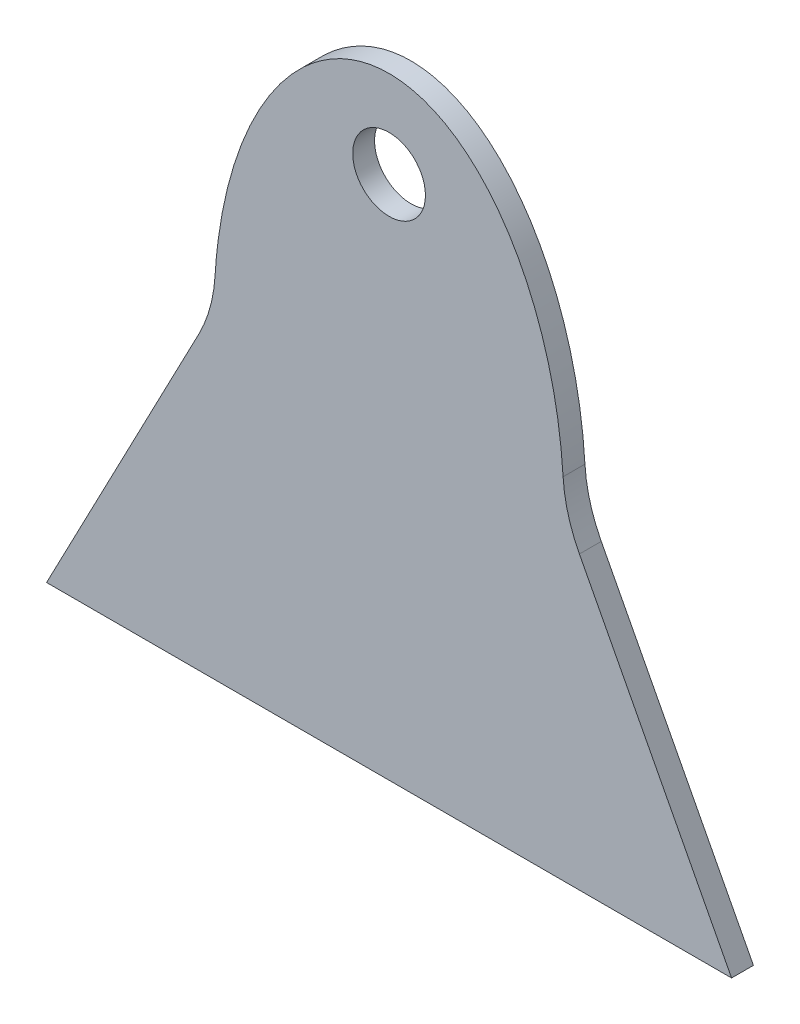
ISO-10303-21;
HEADER;
FILE_DESCRIPTION(('STEP AP214'),'2;1');
FILE_NAME('part.step','',(''),(''),'','','');
FILE_SCHEMA(('AUTOMOTIVE_DESIGN { 1 0 10303 214 1 1 1 1 }'));
ENDSEC;
DATA;
#1=APPLICATION_CONTEXT('core data for automotive mechanical design processes');
#2=APPLICATION_PROTOCOL_DEFINITION('international standard','automotive_design',2000,#1);
#3=PRODUCT_CONTEXT('',#1,'mechanical');
#4=PRODUCT('Part','Part','',(#3));
#5=PRODUCT_RELATED_PRODUCT_CATEGORY('part','',(#4));
#6=PRODUCT_DEFINITION_FORMATION('','',#4);
#7=PRODUCT_DEFINITION_CONTEXT('part definition',#1,'design');
#8=PRODUCT_DEFINITION('design','',#6,#7);
#9=PRODUCT_DEFINITION_SHAPE('','',#8);
#10=(LENGTH_UNIT() NAMED_UNIT(*) SI_UNIT(.MILLI.,.METRE.));
#11=(NAMED_UNIT(*) PLANE_ANGLE_UNIT() SI_UNIT($,.RADIAN.));
#12=(NAMED_UNIT(*) SI_UNIT($,.STERADIAN.) SOLID_ANGLE_UNIT());
#13=UNCERTAINTY_MEASURE_WITH_UNIT(LENGTH_MEASURE(1.E-05),#10,'distance_accuracy_value','');
#14=(GEOMETRIC_REPRESENTATION_CONTEXT(3) GLOBAL_UNCERTAINTY_ASSIGNED_CONTEXT((#13)) GLOBAL_UNIT_ASSIGNED_CONTEXT((#10,
#11,#12)) REPRESENTATION_CONTEXT('',''));
#15=CARTESIAN_POINT('',(0.,0.,0.));
#16=DIRECTION('',(0.,0.,1.));
#17=DIRECTION('',(1.,0.,0.));
#18=AXIS2_PLACEMENT_3D('',#15,#16,#17);
#19=CARTESIAN_POINT('',(0.,0.,19.05));
#20=DIRECTION('',(0.,0.,1.));
#21=DIRECTION('',(1.,0.,0.));
#22=AXIS2_PLACEMENT_3D('',#19,#20,#21);
#23=PLANE('',#22);
#24=DIRECTION('',(-0.463254209343681,0.88622544396184,0.));
#25=VECTOR('',#24,1.);
#26=CARTESIAN_POINT('',(152.4,0.,19.05));
#27=LINE('',#26,#25);
#28=CARTESIAN_POINT('',(298.45,-279.400000000005,19.05));
#29=VERTEX_POINT('',#28);
#30=CARTESIAN_POINT('',(165.851866868121,-25.7340061824933,19.05));
#31=VERTEX_POINT('',#30);
#32=EDGE_CURVE('E114',#29,#31,#27,.T.);
#33=ORIENTED_EDGE('',*,*,#32,.T.);
#34=CARTESIAN_POINT('',(278.402498251275,33.0992784041542,19.05));
#35=DIRECTION('',(0.,0.,1.));
#36=DIRECTION('',(1.,0.,0.));
#37=AXIS2_PLACEMENT_3D('',#34,#35,#36);
#38=CIRCLE('',#37,127.);
#39=CARTESIAN_POINT('',(151.633548073588,25.4420419021757,19.05));
#40=VERTEX_POINT('',#39);
#41=EDGE_CURVE('E11',#31,#40,#38,.F.);
#42=ORIENTED_EDGE('',*,*,#41,.T.);
#43=CARTESIAN_POINT('',(0.,0.,19.05));
#44=DIRECTION('',(0.,0.,1.));
#45=DIRECTION('',(0.,1.,0.));
#46=AXIS2_PLACEMENT_3D('',#43,#44,#45);
#47=ELLIPSE('',#46,254.,152.4);
#48=CARTESIAN_POINT('',(-151.633548073588,25.4420419021757,19.05));
#49=VERTEX_POINT('',#48);
#50=EDGE_CURVE('E133',#40,#49,#47,.T.);
#51=ORIENTED_EDGE('',*,*,#50,.T.);
#52=CARTESIAN_POINT('',(-278.402498251275,33.0992784041542,19.05));
#53=DIRECTION('',(0.,0.,1.));
#54=DIRECTION('',(1.,0.,0.));
#55=AXIS2_PLACEMENT_3D('',#52,#53,#54);
#56=CIRCLE('',#55,127.);
#57=CARTESIAN_POINT('',(-165.851866868121,-25.7340061824933,19.05));
#58=VERTEX_POINT('',#57);
#59=EDGE_CURVE('E100',#49,#58,#56,.F.);
#60=ORIENTED_EDGE('',*,*,#59,.T.);
#61=DIRECTION('',(-0.463254209343681,-0.88622544396184,0.));
#62=VECTOR('',#61,1.);
#63=CARTESIAN_POINT('',(-152.4,0.,19.05));
#64=LINE('',#63,#62);
#65=CARTESIAN_POINT('',(-298.45,-279.400000000005,19.05));
#66=VERTEX_POINT('',#65);
#67=EDGE_CURVE('E93',#58,#66,#64,.T.);
#68=ORIENTED_EDGE('',*,*,#67,.T.);
#69=DIRECTION('',(1.,0.,0.));
#70=VECTOR('',#69,1.);
#71=CARTESIAN_POINT('',(298.45,-279.400000000005,19.05));
#72=LINE('',#71,#70);
#73=EDGE_CURVE('E97',#66,#29,#72,.T.);
#74=ORIENTED_EDGE('',*,*,#73,.T.);
#75=EDGE_LOOP('',(#33,#42,#51,#60,#68,#74));
#76=FACE_BOUND('',#75,.T.);
#77=CARTESIAN_POINT('',(0.,177.8,19.05));
#78=DIRECTION('',(0.,0.,1.));
#79=DIRECTION('',(1.,0.,0.));
#80=AXIS2_PLACEMENT_3D('',#77,#78,#79);
#81=CIRCLE('',#80,31.6865);
#82=CARTESIAN_POINT('',(31.6865,177.8,19.05));
#83=VERTEX_POINT('',#82);
#84=EDGE_CURVE('E127',#83,#83,#81,.T.);
#85=ORIENTED_EDGE('',*,*,#84,.F.);
#86=EDGE_LOOP('',(#85));
#87=FACE_BOUND('',#86,.T.);
#88=ADVANCED_FACE('F41',(#76,#87),#23,.T.);
#89=CARTESIAN_POINT('',(0.,0.,0.));
#90=DIRECTION('',(0.,0.,1.));
#91=DIRECTION('',(1.,0.,0.));
#92=AXIS2_PLACEMENT_3D('',#89,#90,#91);
#93=PLANE('',#92);
#94=CARTESIAN_POINT('',(0.,0.,0.));
#95=DIRECTION('',(0.,0.,1.));
#96=DIRECTION('',(0.,1.,0.));
#97=AXIS2_PLACEMENT_3D('',#94,#95,#96);
#98=ELLIPSE('',#97,254.,152.4);
#99=CARTESIAN_POINT('',(151.633548073588,25.4420419021757,0.));
#100=VERTEX_POINT('',#99);
#101=CARTESIAN_POINT('',(-151.633548073588,25.4420419021757,0.));
#102=VERTEX_POINT('',#101);
#103=EDGE_CURVE('E130',#100,#102,#98,.T.);
#104=ORIENTED_EDGE('',*,*,#103,.F.);
#105=CARTESIAN_POINT('',(278.402498251275,33.0992784041542,0.));
#106=DIRECTION('',(0.,0.,1.));
#107=DIRECTION('',(1.,0.,0.));
#108=AXIS2_PLACEMENT_3D('',#105,#106,#107);
#109=CIRCLE('',#108,127.);
#110=CARTESIAN_POINT('',(165.851866868121,-25.7340061824933,0.));
#111=VERTEX_POINT('',#110);
#112=EDGE_CURVE('E49',#100,#111,#109,.T.);
#113=ORIENTED_EDGE('',*,*,#112,.T.);
#114=DIRECTION('',(0.463254209343681,-0.88622544396184,0.));
#115=VECTOR('',#114,1.);
#116=CARTESIAN_POINT('',(152.4,0.,0.));
#117=LINE('',#116,#115);
#118=CARTESIAN_POINT('',(298.45,-279.400000000005,0.));
#119=VERTEX_POINT('',#118);
#120=EDGE_CURVE('E126',#111,#119,#117,.T.);
#121=ORIENTED_EDGE('',*,*,#120,.T.);
#122=DIRECTION('',(-1.,0.,0.));
#123=VECTOR('',#122,1.);
#124=CARTESIAN_POINT('',(298.45,-279.400000000005,0.));
#125=LINE('',#124,#123);
#126=CARTESIAN_POINT('',(-298.45,-279.400000000005,0.));
#127=VERTEX_POINT('',#126);
#128=EDGE_CURVE('E122',#119,#127,#125,.T.);
#129=ORIENTED_EDGE('',*,*,#128,.T.);
#130=DIRECTION('',(0.463254209343681,0.88622544396184,0.));
#131=VECTOR('',#130,1.);
#132=CARTESIAN_POINT('',(-152.4,0.,0.));
#133=LINE('',#132,#131);
#134=CARTESIAN_POINT('',(-165.851866868121,-25.7340061824933,0.));
#135=VERTEX_POINT('',#134);
#136=EDGE_CURVE('E110',#127,#135,#133,.T.);
#137=ORIENTED_EDGE('',*,*,#136,.T.);
#138=CARTESIAN_POINT('',(-278.402498251275,33.0992784041542,0.));
#139=DIRECTION('',(0.,0.,1.));
#140=DIRECTION('',(1.,0.,0.));
#141=AXIS2_PLACEMENT_3D('',#138,#139,#140);
#142=CIRCLE('',#141,127.);
#143=EDGE_CURVE('E172',#135,#102,#142,.T.);
#144=ORIENTED_EDGE('',*,*,#143,.T.);
#145=EDGE_LOOP('',(#104,#113,#121,#129,#137,#144));
#146=FACE_BOUND('',#145,.T.);
#147=CARTESIAN_POINT('',(0.,177.8,0.));
#148=DIRECTION('',(0.,0.,1.));
#149=DIRECTION('',(1.,0.,0.));
#150=AXIS2_PLACEMENT_3D('',#147,#148,#149);
#151=CIRCLE('',#150,31.6865);
#152=CARTESIAN_POINT('',(31.6865,177.8,0.));
#153=VERTEX_POINT('',#152);
#154=EDGE_CURVE('E125',#153,#153,#151,.T.);
#155=ORIENTED_EDGE('',*,*,#154,.T.);
#156=EDGE_LOOP('',(#155));
#157=FACE_BOUND('',#156,.T.);
#158=ADVANCED_FACE('F143',(#146,#157),#93,.F.);
#159=DIRECTION('',(0.,0.,-1.));
#160=VECTOR('',#159,1.);
#161=SURFACE_OF_LINEAR_EXTRUSION('',#47,#160);
#162=ORIENTED_EDGE('',*,*,#103,.T.);
#163=DIRECTION('',(0.,0.,-1.));
#164=VECTOR('',#163,1.);
#165=CARTESIAN_POINT('',(-151.633548073588,25.4420419021757,0.));
#166=LINE('',#165,#164);
#167=EDGE_CURVE('E173',#102,#49,#166,.F.);
#168=ORIENTED_EDGE('',*,*,#167,.T.);
#169=ORIENTED_EDGE('',*,*,#50,.F.);
#170=DIRECTION('',(0.,0.,-1.));
#171=VECTOR('',#170,1.);
#172=CARTESIAN_POINT('',(151.633548073588,25.4420419021757,19.05));
#173=LINE('',#172,#171);
#174=EDGE_CURVE('E176',#40,#100,#173,.T.);
#175=ORIENTED_EDGE('',*,*,#174,.T.);
#176=EDGE_LOOP('',(#162,#168,#169,#175));
#177=FACE_BOUND('',#176,.T.);
#178=ADVANCED_FACE('F139',(#177),#161,.F.);
#179=CARTESIAN_POINT('',(0.,177.8,19.05));
#180=DIRECTION('',(0.,0.,-1.));
#181=DIRECTION('',(-1.,0.,0.));
#182=AXIS2_PLACEMENT_3D('',#179,#180,#181);
#183=CYLINDRICAL_SURFACE('',#182,31.6865);
#184=ORIENTED_EDGE('',*,*,#84,.T.);
#185=EDGE_LOOP('',(#184));
#186=FACE_BOUND('',#185,.T.);
#187=ORIENTED_EDGE('',*,*,#154,.F.);
#188=EDGE_LOOP('',(#187));
#189=FACE_BOUND('',#188,.T.);
#190=ADVANCED_FACE('F142',(#186,#189),#183,.F.);
#191=CARTESIAN_POINT('',(152.4,0.,-659.055361862721));
#192=DIRECTION('',(0.88622544396184,0.463254209343681,0.));
#193=DIRECTION('',(-0.463254209343681,0.88622544396184,0.));
#194=AXIS2_PLACEMENT_3D('',#191,#192,#193);
#195=PLANE('',#194);
#196=ORIENTED_EDGE('',*,*,#120,.F.);
#197=DIRECTION('',(0.,0.,-1.));
#198=VECTOR('',#197,1.);
#199=CARTESIAN_POINT('',(165.851866868121,-25.7340061824933,-659.055361862721));
#200=LINE('',#199,#198);
#201=EDGE_CURVE('E56',#111,#31,#200,.F.);
#202=ORIENTED_EDGE('',*,*,#201,.T.);
#203=ORIENTED_EDGE('',*,*,#32,.F.);
#204=DIRECTION('',(0.,0.,1.));
#205=VECTOR('',#204,1.);
#206=CARTESIAN_POINT('',(298.45,-279.400000000005,-659.055361862721));
#207=LINE('',#206,#205);
#208=EDGE_CURVE('E113',#119,#29,#207,.T.);
#209=ORIENTED_EDGE('',*,*,#208,.F.);
#210=EDGE_LOOP('',(#196,#202,#203,#209));
#211=FACE_BOUND('',#210,.T.);
#212=ADVANCED_FACE('F162',(#211),#195,.T.);
#213=CARTESIAN_POINT('',(298.45,-279.400000000005,-659.055361862721));
#214=DIRECTION('',(0.,-1.,0.));
#215=DIRECTION('',(1.,0.,0.));
#216=AXIS2_PLACEMENT_3D('',#213,#214,#215);
#217=PLANE('',#216);
#218=ORIENTED_EDGE('',*,*,#128,.F.);
#219=ORIENTED_EDGE('',*,*,#208,.T.);
#220=ORIENTED_EDGE('',*,*,#73,.F.);
#221=DIRECTION('',(0.,0.,1.));
#222=VECTOR('',#221,1.);
#223=CARTESIAN_POINT('',(-298.45,-279.400000000005,-659.055361862721));
#224=LINE('',#223,#222);
#225=EDGE_CURVE('E107',#127,#66,#224,.T.);
#226=ORIENTED_EDGE('',*,*,#225,.F.);
#227=EDGE_LOOP('',(#218,#219,#220,#226));
#228=FACE_BOUND('',#227,.T.);
#229=ADVANCED_FACE('F116',(#228),#217,.T.);
#230=CARTESIAN_POINT('',(-152.4,0.,-659.055361862721));
#231=DIRECTION('',(-0.88622544396184,0.463254209343681,0.));
#232=DIRECTION('',(-0.463254209343681,-0.88622544396184,0.));
#233=AXIS2_PLACEMENT_3D('',#230,#231,#232);
#234=PLANE('',#233);
#235=ORIENTED_EDGE('',*,*,#67,.F.);
#236=DIRECTION('',(0.,0.,-1.));
#237=VECTOR('',#236,1.);
#238=CARTESIAN_POINT('',(-165.851866868121,-25.7340061824933,-659.055361862721));
#239=LINE('',#238,#237);
#240=EDGE_CURVE('E136',#58,#135,#239,.T.);
#241=ORIENTED_EDGE('',*,*,#240,.T.);
#242=ORIENTED_EDGE('',*,*,#136,.F.);
#243=ORIENTED_EDGE('',*,*,#225,.T.);
#244=EDGE_LOOP('',(#235,#241,#242,#243));
#245=FACE_BOUND('',#244,.T.);
#246=ADVANCED_FACE('F108',(#245),#234,.T.);
#247=CARTESIAN_POINT('',(-278.402498251275,33.0992784041542,9.525));
#248=DIRECTION('',(0.,0.,-1.));
#249=DIRECTION('',(-1.,0.,0.));
#250=AXIS2_PLACEMENT_3D('',#247,#248,#249);
#251=CYLINDRICAL_SURFACE('',#250,127.);
#252=ORIENTED_EDGE('',*,*,#59,.F.);
#253=ORIENTED_EDGE('',*,*,#167,.F.);
#254=ORIENTED_EDGE('',*,*,#143,.F.);
#255=ORIENTED_EDGE('',*,*,#240,.F.);
#256=EDGE_LOOP('',(#252,#253,#254,#255));
#257=FACE_BOUND('',#256,.T.);
#258=ADVANCED_FACE('F146',(#257),#251,.F.);
#259=CARTESIAN_POINT('',(278.402498251275,33.0992784041542,9.525));
#260=DIRECTION('',(0.,0.,-1.));
#261=DIRECTION('',(-1.,0.,0.));
#262=AXIS2_PLACEMENT_3D('',#259,#260,#261);
#263=CYLINDRICAL_SURFACE('',#262,127.);
#264=ORIENTED_EDGE('',*,*,#41,.F.);
#265=ORIENTED_EDGE('',*,*,#201,.F.);
#266=ORIENTED_EDGE('',*,*,#112,.F.);
#267=ORIENTED_EDGE('',*,*,#174,.F.);
#268=EDGE_LOOP('',(#264,#265,#266,#267));
#269=FACE_BOUND('',#268,.T.);
#270=ADVANCED_FACE('F43',(#269),#263,.F.);
#271=CLOSED_SHELL('',(#88,#158,#178,#190,#212,#229,#246,#258,#270));
#272=MANIFOLD_SOLID_BREP('B2',#271);
#273=ADVANCED_BREP_SHAPE_REPRESENTATION('',(#18,#272),#14);
#274=SHAPE_DEFINITION_REPRESENTATION(#9,#273);
ENDSEC;
END-ISO-10303-21;
